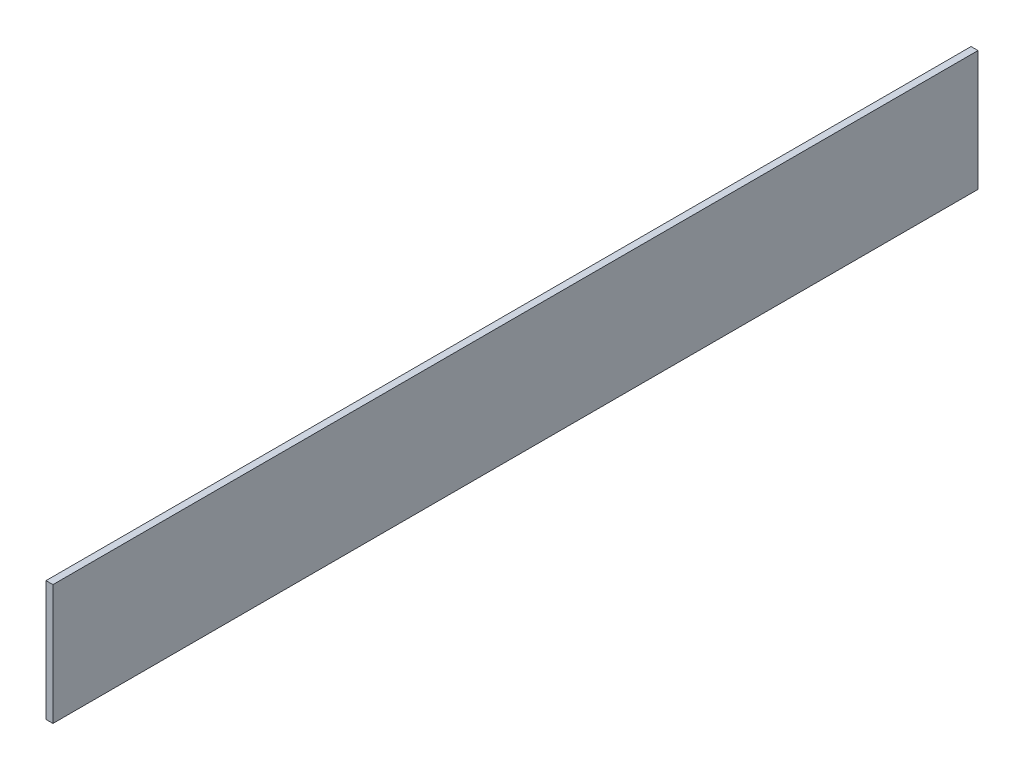
ISO-10303-21;
HEADER;
FILE_DESCRIPTION(('STEP AP214'),'2;1');
FILE_NAME('part.step','',(''),(''),'','','');
FILE_SCHEMA(('AUTOMOTIVE_DESIGN { 1 0 10303 214 1 1 1 1 }'));
ENDSEC;
DATA;
#1=APPLICATION_CONTEXT('core data for automotive mechanical design processes');
#2=APPLICATION_PROTOCOL_DEFINITION('international standard','automotive_design',2000,#1);
#3=PRODUCT_CONTEXT('',#1,'mechanical');
#4=PRODUCT('Part','Part','',(#3));
#5=PRODUCT_RELATED_PRODUCT_CATEGORY('part','',(#4));
#6=PRODUCT_DEFINITION_FORMATION('','',#4);
#7=PRODUCT_DEFINITION_CONTEXT('part definition',#1,'design');
#8=PRODUCT_DEFINITION('design','',#6,#7);
#9=PRODUCT_DEFINITION_SHAPE('','',#8);
#10=(LENGTH_UNIT() NAMED_UNIT(*) SI_UNIT(.MILLI.,.METRE.));
#11=(NAMED_UNIT(*) PLANE_ANGLE_UNIT() SI_UNIT($,.RADIAN.));
#12=(NAMED_UNIT(*) SI_UNIT($,.STERADIAN.) SOLID_ANGLE_UNIT());
#13=UNCERTAINTY_MEASURE_WITH_UNIT(LENGTH_MEASURE(1.E-05),#10,'distance_accuracy_value','');
#14=(GEOMETRIC_REPRESENTATION_CONTEXT(3) GLOBAL_UNCERTAINTY_ASSIGNED_CONTEXT((#13)) GLOBAL_UNIT_ASSIGNED_CONTEXT((#10,
#11,#12)) REPRESENTATION_CONTEXT('',''));
#15=CARTESIAN_POINT('',(0.,0.,0.));
#16=DIRECTION('',(0.,0.,1.));
#17=DIRECTION('',(1.,0.,0.));
#18=AXIS2_PLACEMENT_3D('',#15,#16,#17);
#19=CARTESIAN_POINT('',(0.,0.,635.));
#20=DIRECTION('',(1.,0.,0.));
#21=DIRECTION('',(0.,1.,0.));
#22=AXIS2_PLACEMENT_3D('',#19,#20,#21);
#23=PLANE('',#22);
#24=DIRECTION('',(0.,-1.,0.));
#25=VECTOR('',#24,1.);
#26=CARTESIAN_POINT('',(0.,0.,0.));
#27=LINE('',#26,#25);
#28=CARTESIAN_POINT('',(0.,82.55,0.));
#29=VERTEX_POINT('',#28);
#30=CARTESIAN_POINT('',(0.,0.,0.));
#31=VERTEX_POINT('',#30);
#32=EDGE_CURVE('E97',#29,#31,#27,.T.);
#33=ORIENTED_EDGE('',*,*,#32,.T.);
#34=DIRECTION('',(0.,0.,-1.));
#35=VECTOR('',#34,1.);
#36=CARTESIAN_POINT('',(0.,0.,635.));
#37=LINE('',#36,#35);
#38=CARTESIAN_POINT('',(0.,0.,635.));
#39=VERTEX_POINT('',#38);
#40=EDGE_CURVE('E11',#39,#31,#37,.T.);
#41=ORIENTED_EDGE('',*,*,#40,.F.);
#42=DIRECTION('',(0.,-1.,0.));
#43=VECTOR('',#42,1.);
#44=CARTESIAN_POINT('',(0.,0.,635.));
#45=LINE('',#44,#43);
#46=CARTESIAN_POINT('',(0.,82.55,635.));
#47=VERTEX_POINT('',#46);
#48=EDGE_CURVE('E85',#47,#39,#45,.T.);
#49=ORIENTED_EDGE('',*,*,#48,.F.);
#50=DIRECTION('',(0.,0.,-1.));
#51=VECTOR('',#50,1.);
#52=CARTESIAN_POINT('',(0.,82.55,635.));
#53=LINE('',#52,#51);
#54=EDGE_CURVE('E93',#47,#29,#53,.T.);
#55=ORIENTED_EDGE('',*,*,#54,.T.);
#56=EDGE_LOOP('',(#33,#41,#49,#55));
#57=FACE_BOUND('',#56,.T.);
#58=ADVANCED_FACE('F34',(#57),#23,.F.);
#59=CARTESIAN_POINT('',(0.,0.,635.));
#60=DIRECTION('',(0.,1.,0.));
#61=DIRECTION('',(0.,0.,1.));
#62=AXIS2_PLACEMENT_3D('',#59,#60,#61);
#63=PLANE('',#62);
#64=DIRECTION('',(1.,0.,0.));
#65=VECTOR('',#64,1.);
#66=CARTESIAN_POINT('',(0.,0.,0.));
#67=LINE('',#66,#65);
#68=CARTESIAN_POINT('',(4.7625,0.,0.));
#69=VERTEX_POINT('',#68);
#70=EDGE_CURVE('E89',#31,#69,#67,.T.);
#71=ORIENTED_EDGE('',*,*,#70,.T.);
#72=DIRECTION('',(0.,0.,-1.));
#73=VECTOR('',#72,1.);
#74=CARTESIAN_POINT('',(4.7625,0.,635.));
#75=LINE('',#74,#73);
#76=CARTESIAN_POINT('',(4.7625,0.,635.));
#77=VERTEX_POINT('',#76);
#78=EDGE_CURVE('E42',#77,#69,#75,.T.);
#79=ORIENTED_EDGE('',*,*,#78,.F.);
#80=DIRECTION('',(1.,0.,0.));
#81=VECTOR('',#80,1.);
#82=CARTESIAN_POINT('',(0.,0.,635.));
#83=LINE('',#82,#81);
#84=EDGE_CURVE('E80',#39,#77,#83,.T.);
#85=ORIENTED_EDGE('',*,*,#84,.F.);
#86=ORIENTED_EDGE('',*,*,#40,.T.);
#87=EDGE_LOOP('',(#71,#79,#85,#86));
#88=FACE_BOUND('',#87,.T.);
#89=ADVANCED_FACE('F88',(#88),#63,.F.);
#90=CARTESIAN_POINT('',(4.7625,0.,635.));
#91=DIRECTION('',(-1.,0.,0.));
#92=DIRECTION('',(0.,-1.,0.));
#93=AXIS2_PLACEMENT_3D('',#90,#91,#92);
#94=PLANE('',#93);
#95=DIRECTION('',(0.,1.,0.));
#96=VECTOR('',#95,1.);
#97=CARTESIAN_POINT('',(4.7625,0.,0.));
#98=LINE('',#97,#96);
#99=CARTESIAN_POINT('',(4.76249999999999,82.55,0.));
#100=VERTEX_POINT('',#99);
#101=EDGE_CURVE('E67',#69,#100,#98,.T.);
#102=ORIENTED_EDGE('',*,*,#101,.T.);
#103=DIRECTION('',(0.,0.,-1.));
#104=VECTOR('',#103,1.);
#105=CARTESIAN_POINT('',(4.76249999999999,82.55,635.));
#106=LINE('',#105,#104);
#107=CARTESIAN_POINT('',(4.76249999999999,82.55,635.));
#108=VERTEX_POINT('',#107);
#109=EDGE_CURVE('E90',#108,#100,#106,.T.);
#110=ORIENTED_EDGE('',*,*,#109,.F.);
#111=DIRECTION('',(0.,1.,0.));
#112=VECTOR('',#111,1.);
#113=CARTESIAN_POINT('',(4.7625,0.,635.));
#114=LINE('',#113,#112);
#115=EDGE_CURVE('E83',#77,#108,#114,.T.);
#116=ORIENTED_EDGE('',*,*,#115,.F.);
#117=ORIENTED_EDGE('',*,*,#78,.T.);
#118=EDGE_LOOP('',(#102,#110,#116,#117));
#119=FACE_BOUND('',#118,.T.);
#120=ADVANCED_FACE('F91',(#119),#94,.F.);
#121=CARTESIAN_POINT('',(0.,82.55,635.));
#122=DIRECTION('',(0.,-1.,0.));
#123=DIRECTION('',(0.,0.,-1.));
#124=AXIS2_PLACEMENT_3D('',#121,#122,#123);
#125=PLANE('',#124);
#126=DIRECTION('',(-1.,0.,0.));
#127=VECTOR('',#126,1.);
#128=CARTESIAN_POINT('',(0.,82.55,0.));
#129=LINE('',#128,#127);
#130=EDGE_CURVE('E73',#100,#29,#129,.T.);
#131=ORIENTED_EDGE('',*,*,#130,.T.);
#132=ORIENTED_EDGE('',*,*,#54,.F.);
#133=DIRECTION('',(-1.,0.,0.));
#134=VECTOR('',#133,1.);
#135=CARTESIAN_POINT('',(0.,82.55,635.));
#136=LINE('',#135,#134);
#137=EDGE_CURVE('E50',#108,#47,#136,.T.);
#138=ORIENTED_EDGE('',*,*,#137,.F.);
#139=ORIENTED_EDGE('',*,*,#109,.T.);
#140=EDGE_LOOP('',(#131,#132,#138,#139));
#141=FACE_BOUND('',#140,.T.);
#142=ADVANCED_FACE('F104',(#141),#125,.F.);
#143=CARTESIAN_POINT('',(0.,0.,635.));
#144=DIRECTION('',(0.,0.,-1.));
#145=DIRECTION('',(-1.,0.,0.));
#146=AXIS2_PLACEMENT_3D('',#143,#144,#145);
#147=PLANE('',#146);
#148=ORIENTED_EDGE('',*,*,#48,.T.);
#149=ORIENTED_EDGE('',*,*,#84,.T.);
#150=ORIENTED_EDGE('',*,*,#115,.T.);
#151=ORIENTED_EDGE('',*,*,#137,.T.);
#152=EDGE_LOOP('',(#148,#149,#150,#151));
#153=FACE_BOUND('',#152,.T.);
#154=ADVANCED_FACE('F81',(#153),#147,.F.);
#155=CARTESIAN_POINT('',(0.,0.,0.));
#156=DIRECTION('',(0.,0.,-1.));
#157=DIRECTION('',(-1.,0.,0.));
#158=AXIS2_PLACEMENT_3D('',#155,#156,#157);
#159=PLANE('',#158);
#160=ORIENTED_EDGE('',*,*,#32,.F.);
#161=ORIENTED_EDGE('',*,*,#130,.F.);
#162=ORIENTED_EDGE('',*,*,#101,.F.);
#163=ORIENTED_EDGE('',*,*,#70,.F.);
#164=EDGE_LOOP('',(#160,#161,#162,#163));
#165=FACE_BOUND('',#164,.T.);
#166=ADVANCED_FACE('F107',(#165),#159,.T.);
#167=CLOSED_SHELL('',(#58,#89,#120,#142,#154,#166));
#168=MANIFOLD_SOLID_BREP('B2',#167);
#169=ADVANCED_BREP_SHAPE_REPRESENTATION('',(#18,#168),#14);
#170=SHAPE_DEFINITION_REPRESENTATION(#9,#169);
ENDSEC;
END-ISO-10303-21;
